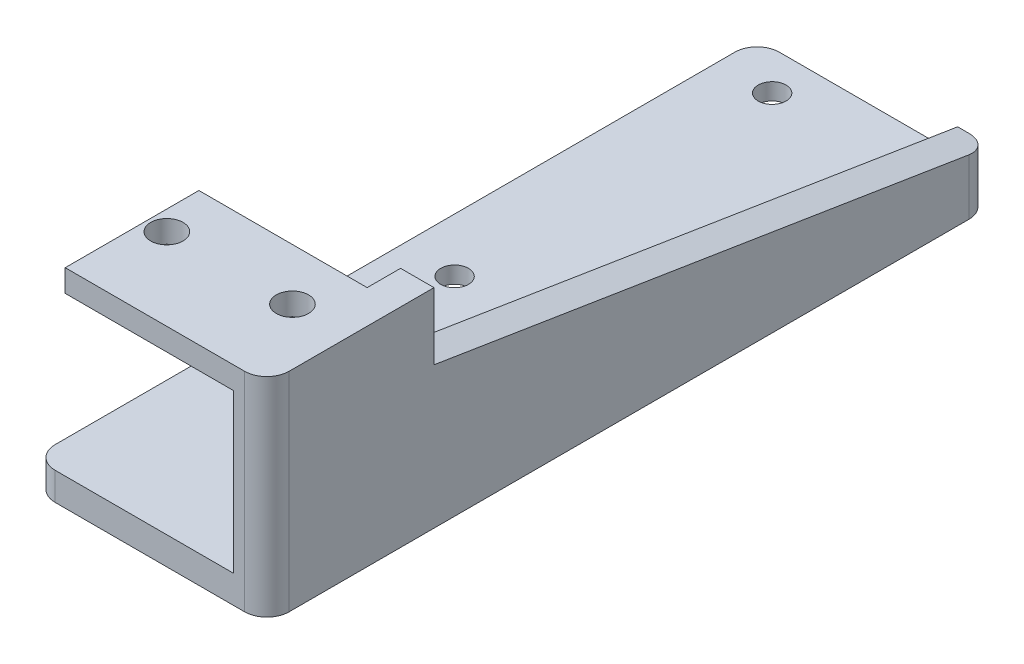
ISO-10303-21;
HEADER;
FILE_DESCRIPTION(('STEP AP214'),'2;1');
FILE_NAME('part.step','',(''),(''),'','','');
FILE_SCHEMA(('AUTOMOTIVE_DESIGN { 1 0 10303 214 1 1 1 1 }'));
ENDSEC;
DATA;
#1=APPLICATION_CONTEXT('core data for automotive mechanical design processes');
#2=APPLICATION_PROTOCOL_DEFINITION('international standard','automotive_design',2000,#1);
#3=PRODUCT_CONTEXT('',#1,'mechanical');
#4=PRODUCT('Part','Part','',(#3));
#5=PRODUCT_RELATED_PRODUCT_CATEGORY('part','',(#4));
#6=PRODUCT_DEFINITION_FORMATION('','',#4);
#7=PRODUCT_DEFINITION_CONTEXT('part definition',#1,'design');
#8=PRODUCT_DEFINITION('design','',#6,#7);
#9=PRODUCT_DEFINITION_SHAPE('','',#8);
#10=(LENGTH_UNIT() NAMED_UNIT(*) SI_UNIT(.MILLI.,.METRE.));
#11=(NAMED_UNIT(*) PLANE_ANGLE_UNIT() SI_UNIT($,.RADIAN.));
#12=(NAMED_UNIT(*) SI_UNIT($,.STERADIAN.) SOLID_ANGLE_UNIT());
#13=UNCERTAINTY_MEASURE_WITH_UNIT(LENGTH_MEASURE(1.E-05),#10,'distance_accuracy_value','');
#14=(GEOMETRIC_REPRESENTATION_CONTEXT(3) GLOBAL_UNCERTAINTY_ASSIGNED_CONTEXT((#13)) GLOBAL_UNIT_ASSIGNED_CONTEXT((#10,
#11,#12)) REPRESENTATION_CONTEXT('',''));
#15=CARTESIAN_POINT('',(0.,0.,0.));
#16=DIRECTION('',(0.,0.,1.));
#17=DIRECTION('',(1.,0.,0.));
#18=AXIS2_PLACEMENT_3D('',#15,#16,#17);
#19=CARTESIAN_POINT('',(1.95,-16.701,32.));
#20=DIRECTION('',(0.,1.,0.));
#21=DIRECTION('',(-1.,0.,0.));
#22=AXIS2_PLACEMENT_3D('',#19,#20,#21);
#23=CYLINDRICAL_SURFACE('',#22,1.25);
#24=CARTESIAN_POINT('',(1.95,-14.2,32.));
#25=DIRECTION('',(0.,1.,0.));
#26=DIRECTION('',(-1.,0.,0.));
#27=AXIS2_PLACEMENT_3D('',#24,#25,#26);
#28=CIRCLE('',#27,1.25);
#29=CARTESIAN_POINT('',(0.700000000000003,-14.2,32.));
#30=VERTEX_POINT('',#29);
#31=EDGE_CURVE('E167',#30,#30,#28,.T.);
#32=ORIENTED_EDGE('',*,*,#31,.T.);
#33=EDGE_LOOP('',(#32));
#34=FACE_BOUND('',#33,.T.);
#35=CARTESIAN_POINT('',(1.95,-15.7,32.));
#36=DIRECTION('',(0.,-1.,0.));
#37=DIRECTION('',(0.,0.,-1.));
#38=AXIS2_PLACEMENT_3D('',#35,#36,#37);
#39=CIRCLE('',#38,1.25);
#40=CARTESIAN_POINT('',(1.95,-15.7,30.75));
#41=VERTEX_POINT('',#40);
#42=EDGE_CURVE('E42',#41,#41,#39,.F.);
#43=ORIENTED_EDGE('',*,*,#42,.F.);
#44=EDGE_LOOP('',(#43));
#45=FACE_BOUND('',#44,.T.);
#46=ADVANCED_FACE('F38',(#34,#45),#23,.F.);
#47=CARTESIAN_POINT('',(1.95,-16.701,3.5));
#48=DIRECTION('',(0.,1.,0.));
#49=DIRECTION('',(-1.,0.,0.));
#50=AXIS2_PLACEMENT_3D('',#47,#48,#49);
#51=CYLINDRICAL_SURFACE('',#50,1.25);
#52=CARTESIAN_POINT('',(1.95,-14.2,3.5));
#53=DIRECTION('',(0.,1.,0.));
#54=DIRECTION('',(-1.,0.,0.));
#55=AXIS2_PLACEMENT_3D('',#52,#53,#54);
#56=CIRCLE('',#55,1.25);
#57=CARTESIAN_POINT('',(0.7,-14.2,3.5));
#58=VERTEX_POINT('',#57);
#59=EDGE_CURVE('E191',#58,#58,#56,.T.);
#60=ORIENTED_EDGE('',*,*,#59,.T.);
#61=EDGE_LOOP('',(#60));
#62=FACE_BOUND('',#61,.T.);
#63=CARTESIAN_POINT('',(1.95,-15.7,3.5));
#64=DIRECTION('',(0.,-1.,0.));
#65=DIRECTION('',(0.,0.,-1.));
#66=AXIS2_PLACEMENT_3D('',#63,#64,#65);
#67=CIRCLE('',#66,1.25);
#68=CARTESIAN_POINT('',(1.95,-15.7,2.25));
#69=VERTEX_POINT('',#68);
#70=EDGE_CURVE('E180',#69,#69,#67,.F.);
#71=ORIENTED_EDGE('',*,*,#70,.F.);
#72=EDGE_LOOP('',(#71));
#73=FACE_BOUND('',#72,.T.);
#74=ADVANCED_FACE('F425',(#62,#73),#51,.F.);
#75=CARTESIAN_POINT('',(18.1,2.,65.));
#76=DIRECTION('',(0.,-1.,0.));
#77=DIRECTION('',(1.,0.,0.));
#78=AXIS2_PLACEMENT_3D('',#75,#76,#77);
#79=PLANE('',#78);
#80=CARTESIAN_POINT('',(1.765,2.,57.64));
#81=DIRECTION('',(0.,1.,0.));
#82=DIRECTION('',(0.,0.,1.));
#83=AXIS2_PLACEMENT_3D('',#80,#81,#82);
#84=CIRCLE('',#83,1.45);
#85=CARTESIAN_POINT('',(1.765,2.,59.09));
#86=VERTEX_POINT('',#85);
#87=EDGE_CURVE('E219',#86,#86,#84,.T.);
#88=ORIENTED_EDGE('',*,*,#87,.F.);
#89=EDGE_LOOP('',(#88));
#90=FACE_BOUND('',#89,.T.);
#91=CARTESIAN_POINT('',(13.035,2.,57.64));
#92=DIRECTION('',(0.,1.,0.));
#93=DIRECTION('',(0.,0.,1.));
#94=AXIS2_PLACEMENT_3D('',#91,#92,#93);
#95=CIRCLE('',#94,1.45);
#96=CARTESIAN_POINT('',(13.035,2.,59.09));
#97=VERTEX_POINT('',#96);
#98=EDGE_CURVE('E195',#97,#97,#95,.T.);
#99=ORIENTED_EDGE('',*,*,#98,.F.);
#100=EDGE_LOOP('',(#99));
#101=FACE_BOUND('',#100,.T.);
#102=DIRECTION('',(-1.,0.,0.));
#103=VECTOR('',#102,1.);
#104=CARTESIAN_POINT('',(18.1,2.,65.));
#105=LINE('',#104,#103);
#106=CARTESIAN_POINT('',(16.1,2.,65.));
#107=VERTEX_POINT('',#106);
#108=CARTESIAN_POINT('',(0.,2.,65.));
#109=VERTEX_POINT('',#108);
#110=EDGE_CURVE('E230',#107,#109,#105,.T.);
#111=ORIENTED_EDGE('',*,*,#110,.F.);
#112=CARTESIAN_POINT('',(16.1,2.,63.));
#113=DIRECTION('',(0.,-1.,0.));
#114=DIRECTION('',(1.,0.,0.));
#115=AXIS2_PLACEMENT_3D('',#112,#113,#114);
#116=CIRCLE('',#115,2.);
#117=CARTESIAN_POINT('',(18.1,2.,63.));
#118=VERTEX_POINT('',#117);
#119=EDGE_CURVE('E298',#107,#118,#116,.F.);
#120=ORIENTED_EDGE('',*,*,#119,.T.);
#121=DIRECTION('',(0.,0.,-1.));
#122=VECTOR('',#121,1.);
#123=CARTESIAN_POINT('',(18.1,2.,65.));
#124=LINE('',#123,#122);
#125=CARTESIAN_POINT('',(18.1,2.,50.));
#126=VERTEX_POINT('',#125);
#127=EDGE_CURVE('E251',#118,#126,#124,.T.);
#128=ORIENTED_EDGE('',*,*,#127,.T.);
#129=DIRECTION('',(1.,0.,0.));
#130=VECTOR('',#129,1.);
#131=CARTESIAN_POINT('',(-2.901,2.,50.));
#132=LINE('',#131,#130);
#133=CARTESIAN_POINT('',(15.1,2.,50.));
#134=VERTEX_POINT('',#133);
#135=EDGE_CURVE('E168',#134,#126,#132,.T.);
#136=ORIENTED_EDGE('',*,*,#135,.F.);
#137=DIRECTION('',(0.,0.,-1.));
#138=VECTOR('',#137,1.);
#139=CARTESIAN_POINT('',(15.1,2.,0.));
#140=LINE('',#139,#138);
#141=CARTESIAN_POINT('',(15.1,2.,53.));
#142=VERTEX_POINT('',#141);
#143=EDGE_CURVE('E173',#142,#134,#140,.T.);
#144=ORIENTED_EDGE('',*,*,#143,.F.);
#145=DIRECTION('',(1.,0.,0.));
#146=VECTOR('',#145,1.);
#147=CARTESIAN_POINT('',(0.,2.,53.));
#148=LINE('',#147,#146);
#149=CARTESIAN_POINT('',(0.,2.,53.));
#150=VERTEX_POINT('',#149);
#151=EDGE_CURVE('E205',#150,#142,#148,.T.);
#152=ORIENTED_EDGE('',*,*,#151,.F.);
#153=DIRECTION('',(0.,0.,-1.));
#154=VECTOR('',#153,1.);
#155=CARTESIAN_POINT('',(0.,2.,65.));
#156=LINE('',#155,#154);
#157=EDGE_CURVE('E286',#109,#150,#156,.T.);
#158=ORIENTED_EDGE('',*,*,#157,.F.);
#159=EDGE_LOOP('',(#111,#120,#128,#136,#144,#152,#158));
#160=FACE_BOUND('',#159,.T.);
#161=ADVANCED_FACE('F384',(#90,#101,#160),#79,.F.);
#162=CARTESIAN_POINT('',(0.,2.,65.));
#163=DIRECTION('',(1.,0.,0.));
#164=DIRECTION('',(0.,0.,-1.));
#165=AXIS2_PLACEMENT_3D('',#162,#163,#164);
#166=PLANE('',#165);
#167=ORIENTED_EDGE('',*,*,#157,.T.);
#168=DIRECTION('',(0.,1.,0.));
#169=VECTOR('',#168,1.);
#170=CARTESIAN_POINT('',(0.,-16.701,53.));
#171=LINE('',#170,#169);
#172=CARTESIAN_POINT('',(0.,0.,53.));
#173=VERTEX_POINT('',#172);
#174=EDGE_CURVE('E212',#173,#150,#171,.T.);
#175=ORIENTED_EDGE('',*,*,#174,.F.);
#176=DIRECTION('',(0.,0.,-1.));
#177=VECTOR('',#176,1.);
#178=CARTESIAN_POINT('',(0.,0.,65.));
#179=LINE('',#178,#177);
#180=CARTESIAN_POINT('',(0.,0.,65.));
#181=VERTEX_POINT('',#180);
#182=EDGE_CURVE('E282',#181,#173,#179,.T.);
#183=ORIENTED_EDGE('',*,*,#182,.F.);
#184=DIRECTION('',(0.,-1.,0.));
#185=VECTOR('',#184,1.);
#186=CARTESIAN_POINT('',(0.,2.,65.));
#187=LINE('',#186,#185);
#188=EDGE_CURVE('E233',#109,#181,#187,.T.);
#189=ORIENTED_EDGE('',*,*,#188,.F.);
#190=EDGE_LOOP('',(#167,#175,#183,#189));
#191=FACE_BOUND('',#190,.T.);
#192=ADVANCED_FACE('F389',(#191),#166,.F.);
#193=CARTESIAN_POINT('',(0.,0.,65.));
#194=DIRECTION('',(0.,1.,0.));
#195=DIRECTION('',(0.,0.,1.));
#196=AXIS2_PLACEMENT_3D('',#193,#194,#195);
#197=PLANE('',#196);
#198=CARTESIAN_POINT('',(1.765,0.,57.64));
#199=DIRECTION('',(0.,1.,0.));
#200=DIRECTION('',(0.,0.,1.));
#201=AXIS2_PLACEMENT_3D('',#198,#199,#200);
#202=CIRCLE('',#201,1.45);
#203=CARTESIAN_POINT('',(1.765,0.,59.09));
#204=VERTEX_POINT('',#203);
#205=EDGE_CURVE('E215',#204,#204,#202,.F.);
#206=ORIENTED_EDGE('',*,*,#205,.F.);
#207=EDGE_LOOP('',(#206));
#208=FACE_BOUND('',#207,.T.);
#209=CARTESIAN_POINT('',(13.035,0.,57.64));
#210=DIRECTION('',(0.,1.,0.));
#211=DIRECTION('',(0.,0.,1.));
#212=AXIS2_PLACEMENT_3D('',#209,#210,#211);
#213=CIRCLE('',#212,1.45);
#214=CARTESIAN_POINT('',(13.035,0.,59.09));
#215=VERTEX_POINT('',#214);
#216=EDGE_CURVE('E223',#215,#215,#213,.F.);
#217=ORIENTED_EDGE('',*,*,#216,.F.);
#218=EDGE_LOOP('',(#217));
#219=FACE_BOUND('',#218,.T.);
#220=ORIENTED_EDGE('',*,*,#182,.T.);
#221=DIRECTION('',(-1.,0.,0.));
#222=VECTOR('',#221,1.);
#223=CARTESIAN_POINT('',(0.,0.,53.));
#224=LINE('',#223,#222);
#225=CARTESIAN_POINT('',(15.1,0.,53.));
#226=VERTEX_POINT('',#225);
#227=EDGE_CURVE('E199',#226,#173,#224,.T.);
#228=ORIENTED_EDGE('',*,*,#227,.F.);
#229=DIRECTION('',(0.,0.,-1.));
#230=VECTOR('',#229,1.);
#231=CARTESIAN_POINT('',(15.1,0.,65.));
#232=LINE('',#231,#230);
#233=CARTESIAN_POINT('',(15.1,0.,65.));
#234=VERTEX_POINT('',#233);
#235=EDGE_CURVE('E278',#234,#226,#232,.T.);
#236=ORIENTED_EDGE('',*,*,#235,.F.);
#237=DIRECTION('',(1.,0.,0.));
#238=VECTOR('',#237,1.);
#239=CARTESIAN_POINT('',(0.,0.,65.));
#240=LINE('',#239,#238);
#241=EDGE_CURVE('E237',#181,#234,#240,.T.);
#242=ORIENTED_EDGE('',*,*,#241,.F.);
#243=EDGE_LOOP('',(#220,#228,#236,#242));
#244=FACE_BOUND('',#243,.T.);
#245=ADVANCED_FACE('F397',(#208,#219,#244),#197,.F.);
#246=CARTESIAN_POINT('',(15.1,0.,65.));
#247=DIRECTION('',(1.,0.,0.));
#248=DIRECTION('',(0.,1.,0.));
#249=AXIS2_PLACEMENT_3D('',#246,#247,#248);
#250=PLANE('',#249);
#251=ORIENTED_EDGE('',*,*,#143,.T.);
#252=DIRECTION('',(0.,1.,0.));
#253=VECTOR('',#252,1.);
#254=CARTESIAN_POINT('',(15.1,-4.,50.));
#255=LINE('',#254,#253);
#256=CARTESIAN_POINT('',(15.1,-4.,50.));
#257=VERTEX_POINT('',#256);
#258=EDGE_CURVE('E152',#257,#134,#255,.T.);
#259=ORIENTED_EDGE('',*,*,#258,.F.);
#260=DIRECTION('',(0.,0.157990501106673,0.987440631916706));
#261=VECTOR('',#260,1.);
#262=CARTESIAN_POINT('',(15.1,-12.,0.));
#263=LINE('',#262,#261);
#264=CARTESIAN_POINT('',(15.1,-12.,0.));
#265=VERTEX_POINT('',#264);
#266=EDGE_CURVE('E162',#265,#257,#263,.T.);
#267=ORIENTED_EDGE('',*,*,#266,.F.);
#268=DIRECTION('',(0.,-1.,0.));
#269=VECTOR('',#268,1.);
#270=CARTESIAN_POINT('',(15.1,0.,0.));
#271=LINE('',#270,#269);
#272=CARTESIAN_POINT('',(15.1,-14.2,0.));
#273=VERTEX_POINT('',#272);
#274=EDGE_CURVE('E202',#265,#273,#271,.T.);
#275=ORIENTED_EDGE('',*,*,#274,.T.);
#276=DIRECTION('',(0.,0.,-1.));
#277=VECTOR('',#276,1.);
#278=CARTESIAN_POINT('',(15.1,-14.2,65.));
#279=LINE('',#278,#277);
#280=CARTESIAN_POINT('',(15.1,-14.2,65.));
#281=VERTEX_POINT('',#280);
#282=EDGE_CURVE('E274',#281,#273,#279,.T.);
#283=ORIENTED_EDGE('',*,*,#282,.F.);
#284=DIRECTION('',(0.,-1.,0.));
#285=VECTOR('',#284,1.);
#286=CARTESIAN_POINT('',(15.1,0.,65.));
#287=LINE('',#286,#285);
#288=EDGE_CURVE('E240',#234,#281,#287,.T.);
#289=ORIENTED_EDGE('',*,*,#288,.F.);
#290=ORIENTED_EDGE('',*,*,#235,.T.);
#291=DIRECTION('',(0.,1.,0.));
#292=VECTOR('',#291,1.);
#293=CARTESIAN_POINT('',(15.1,-16.701,53.));
#294=LINE('',#293,#292);
#295=EDGE_CURVE('E209',#226,#142,#294,.T.);
#296=ORIENTED_EDGE('',*,*,#295,.T.);
#297=EDGE_LOOP('',(#251,#259,#267,#275,#283,#289,#290,#296));
#298=FACE_BOUND('',#297,.T.);
#299=ADVANCED_FACE('F171',(#298),#250,.F.);
#300=CARTESIAN_POINT('',(15.1,-14.2,65.));
#301=DIRECTION('',(0.,-1.,0.));
#302=DIRECTION('',(0.,0.,-1.));
#303=AXIS2_PLACEMENT_3D('',#300,#301,#302);
#304=PLANE('',#303);
#305=ORIENTED_EDGE('',*,*,#59,.F.);
#306=EDGE_LOOP('',(#305));
#307=FACE_BOUND('',#306,.T.);
#308=ORIENTED_EDGE('',*,*,#31,.F.);
#309=EDGE_LOOP('',(#308));
#310=FACE_BOUND('',#309,.T.);
#311=DIRECTION('',(0.,0.,-1.));
#312=VECTOR('',#311,1.);
#313=CARTESIAN_POINT('',(-2.9,-14.2,65.));
#314=LINE('',#313,#312);
#315=CARTESIAN_POINT('',(-2.9,-14.2,63.));
#316=VERTEX_POINT('',#315);
#317=CARTESIAN_POINT('',(-2.9,-14.2,2.));
#318=VERTEX_POINT('',#317);
#319=EDGE_CURVE('E270',#316,#318,#314,.T.);
#320=ORIENTED_EDGE('',*,*,#319,.F.);
#321=CARTESIAN_POINT('',(-0.899999999999998,-14.2,63.));
#322=DIRECTION('',(0.,-1.,0.));
#323=DIRECTION('',(0.,0.,-1.));
#324=AXIS2_PLACEMENT_3D('',#321,#322,#323);
#325=CIRCLE('',#324,2.);
#326=CARTESIAN_POINT('',(-0.9,-14.2,65.));
#327=VERTEX_POINT('',#326);
#328=EDGE_CURVE('E330',#316,#327,#325,.F.);
#329=ORIENTED_EDGE('',*,*,#328,.T.);
#330=DIRECTION('',(-1.,0.,0.));
#331=VECTOR('',#330,1.);
#332=CARTESIAN_POINT('',(15.1,-14.2,65.));
#333=LINE('',#332,#331);
#334=EDGE_CURVE('E243',#281,#327,#333,.T.);
#335=ORIENTED_EDGE('',*,*,#334,.F.);
#336=ORIENTED_EDGE('',*,*,#282,.T.);
#337=DIRECTION('',(-1.,0.,0.));
#338=VECTOR('',#337,1.);
#339=CARTESIAN_POINT('',(15.1,-14.2,0.));
#340=LINE('',#339,#338);
#341=CARTESIAN_POINT('',(-0.9,-14.2,0.));
#342=VERTEX_POINT('',#341);
#343=EDGE_CURVE('E254',#273,#342,#340,.T.);
#344=ORIENTED_EDGE('',*,*,#343,.T.);
#345=CARTESIAN_POINT('',(-0.899999999999998,-14.2,2.));
#346=DIRECTION('',(0.,-1.,0.));
#347=DIRECTION('',(0.,0.,-1.));
#348=AXIS2_PLACEMENT_3D('',#345,#346,#347);
#349=CIRCLE('',#348,2.);
#350=EDGE_CURVE('E327',#342,#318,#349,.F.);
#351=ORIENTED_EDGE('',*,*,#350,.T.);
#352=EDGE_LOOP('',(#320,#329,#335,#336,#344,#351));
#353=FACE_BOUND('',#352,.T.);
#354=ADVANCED_FACE('F401',(#307,#310,#353),#304,.F.);
#355=CARTESIAN_POINT('',(-2.9,-14.2,65.));
#356=DIRECTION('',(1.,0.,0.));
#357=DIRECTION('',(0.,1.,0.));
#358=AXIS2_PLACEMENT_3D('',#355,#356,#357);
#359=PLANE('',#358);
#360=DIRECTION('',(0.,0.,-1.));
#361=VECTOR('',#360,1.);
#362=CARTESIAN_POINT('',(-2.9,-16.7,65.));
#363=LINE('',#362,#361);
#364=CARTESIAN_POINT('',(-2.9,-16.7,63.));
#365=VERTEX_POINT('',#364);
#366=CARTESIAN_POINT('',(-2.9,-16.7,2.));
#367=VERTEX_POINT('',#366);
#368=EDGE_CURVE('E266',#365,#367,#363,.T.);
#369=ORIENTED_EDGE('',*,*,#368,.F.);
#370=DIRECTION('',(0.,-1.,0.));
#371=VECTOR('',#370,1.);
#372=CARTESIAN_POINT('',(-2.9,-14.2,63.));
#373=LINE('',#372,#371);
#374=EDGE_CURVE('E324',#365,#316,#373,.F.);
#375=ORIENTED_EDGE('',*,*,#374,.T.);
#376=ORIENTED_EDGE('',*,*,#319,.T.);
#377=DIRECTION('',(0.,-1.,0.));
#378=VECTOR('',#377,1.);
#379=CARTESIAN_POINT('',(-2.9,-14.2,2.));
#380=LINE('',#379,#378);
#381=EDGE_CURVE('E320',#318,#367,#380,.T.);
#382=ORIENTED_EDGE('',*,*,#381,.T.);
#383=EDGE_LOOP('',(#369,#375,#376,#382));
#384=FACE_BOUND('',#383,.T.);
#385=ADVANCED_FACE('F365',(#384),#359,.F.);
#386=CARTESIAN_POINT('',(-2.9,-16.7,65.));
#387=DIRECTION('',(0.,1.,0.));
#388=DIRECTION('',(0.,0.,1.));
#389=AXIS2_PLACEMENT_3D('',#386,#387,#388);
#390=PLANE('',#389);
#391=CARTESIAN_POINT('',(1.95,-16.7,32.));
#392=DIRECTION('',(0.,-1.,0.));
#393=DIRECTION('',(0.,0.,-1.));
#394=AXIS2_PLACEMENT_3D('',#391,#392,#393);
#395=CIRCLE('',#394,2.7);
#396=CARTESIAN_POINT('',(1.95,-16.7,29.3));
#397=VERTEX_POINT('',#396);
#398=EDGE_CURVE('E343',#397,#397,#395,.T.);
#399=ORIENTED_EDGE('',*,*,#398,.F.);
#400=EDGE_LOOP('',(#399));
#401=FACE_BOUND('',#400,.T.);
#402=CARTESIAN_POINT('',(1.95,-16.7,3.5));
#403=DIRECTION('',(0.,-1.,0.));
#404=DIRECTION('',(0.,0.,-1.));
#405=AXIS2_PLACEMENT_3D('',#402,#403,#404);
#406=CIRCLE('',#405,2.7);
#407=CARTESIAN_POINT('',(1.95,-16.7,0.799999999999999));
#408=VERTEX_POINT('',#407);
#409=EDGE_CURVE('E182',#408,#408,#406,.T.);
#410=ORIENTED_EDGE('',*,*,#409,.F.);
#411=EDGE_LOOP('',(#410));
#412=FACE_BOUND('',#411,.T.);
#413=DIRECTION('',(0.,0.,-1.));
#414=VECTOR('',#413,1.);
#415=CARTESIAN_POINT('',(18.1,-16.7,65.));
#416=LINE('',#415,#414);
#417=CARTESIAN_POINT('',(18.1,-16.7,63.));
#418=VERTEX_POINT('',#417);
#419=CARTESIAN_POINT('',(18.1,-16.7,2.));
#420=VERTEX_POINT('',#419);
#421=EDGE_CURVE('E262',#418,#420,#416,.T.);
#422=ORIENTED_EDGE('',*,*,#421,.F.);
#423=CARTESIAN_POINT('',(16.1,-16.7,63.));
#424=DIRECTION('',(0.,1.,0.));
#425=DIRECTION('',(0.,0.,1.));
#426=AXIS2_PLACEMENT_3D('',#423,#424,#425);
#427=CIRCLE('',#426,2.);
#428=CARTESIAN_POINT('',(16.1,-16.7,65.));
#429=VERTEX_POINT('',#428);
#430=EDGE_CURVE('E317',#418,#429,#427,.F.);
#431=ORIENTED_EDGE('',*,*,#430,.T.);
#432=DIRECTION('',(1.,0.,0.));
#433=VECTOR('',#432,1.);
#434=CARTESIAN_POINT('',(-2.9,-16.7,65.));
#435=LINE('',#434,#433);
#436=CARTESIAN_POINT('',(-0.9,-16.7,65.));
#437=VERTEX_POINT('',#436);
#438=EDGE_CURVE('E247',#437,#429,#435,.T.);
#439=ORIENTED_EDGE('',*,*,#438,.F.);
#440=CARTESIAN_POINT('',(-0.899999999999999,-16.7,63.));
#441=DIRECTION('',(0.,1.,0.));
#442=DIRECTION('',(0.,0.,1.));
#443=AXIS2_PLACEMENT_3D('',#440,#441,#442);
#444=CIRCLE('',#443,2.);
#445=EDGE_CURVE('E314',#437,#365,#444,.F.);
#446=ORIENTED_EDGE('',*,*,#445,.T.);
#447=ORIENTED_EDGE('',*,*,#368,.T.);
#448=CARTESIAN_POINT('',(-0.899999999999999,-16.7,2.));
#449=DIRECTION('',(0.,1.,0.));
#450=DIRECTION('',(0.,0.,1.));
#451=AXIS2_PLACEMENT_3D('',#448,#449,#450);
#452=CIRCLE('',#451,2.);
#453=CARTESIAN_POINT('',(-0.9,-16.7,0.));
#454=VERTEX_POINT('',#453);
#455=EDGE_CURVE('E308',#367,#454,#452,.F.);
#456=ORIENTED_EDGE('',*,*,#455,.T.);
#457=DIRECTION('',(1.,0.,0.));
#458=VECTOR('',#457,1.);
#459=CARTESIAN_POINT('',(-2.9,-16.7,0.));
#460=LINE('',#459,#458);
#461=CARTESIAN_POINT('',(16.1,-16.7,0.));
#462=VERTEX_POINT('',#461);
#463=EDGE_CURVE('E234',#454,#462,#460,.T.);
#464=ORIENTED_EDGE('',*,*,#463,.T.);
#465=CARTESIAN_POINT('',(16.1,-16.7,2.));
#466=DIRECTION('',(0.,1.,0.));
#467=DIRECTION('',(0.,0.,1.));
#468=AXIS2_PLACEMENT_3D('',#465,#466,#467);
#469=CIRCLE('',#468,2.);
#470=EDGE_CURVE('E311',#462,#420,#469,.F.);
#471=ORIENTED_EDGE('',*,*,#470,.T.);
#472=EDGE_LOOP('',(#422,#431,#439,#446,#447,#456,#464,#471));
#473=FACE_BOUND('',#472,.T.);
#474=ADVANCED_FACE('F361',(#401,#412,#473),#390,.F.);
#475=CARTESIAN_POINT('',(18.1,-16.7,65.));
#476=DIRECTION('',(-1.,0.,0.));
#477=DIRECTION('',(0.,0.,1.));
#478=AXIS2_PLACEMENT_3D('',#475,#476,#477);
#479=PLANE('',#478);
#480=ORIENTED_EDGE('',*,*,#127,.F.);
#481=DIRECTION('',(0.,1.,0.));
#482=VECTOR('',#481,1.);
#483=CARTESIAN_POINT('',(18.1,-16.7,63.));
#484=LINE('',#483,#482);
#485=EDGE_CURVE('E305',#118,#418,#484,.F.);
#486=ORIENTED_EDGE('',*,*,#485,.T.);
#487=ORIENTED_EDGE('',*,*,#421,.T.);
#488=DIRECTION('',(0.,1.,0.));
#489=VECTOR('',#488,1.);
#490=CARTESIAN_POINT('',(18.1,-16.7,2.));
#491=LINE('',#490,#489);
#492=CARTESIAN_POINT('',(18.1,-11.68,2.));
#493=VERTEX_POINT('',#492);
#494=EDGE_CURVE('E301',#420,#493,#491,.T.);
#495=ORIENTED_EDGE('',*,*,#494,.T.);
#496=DIRECTION('',(0.,-0.157990501106673,-0.987440631916705));
#497=VECTOR('',#496,1.);
#498=CARTESIAN_POINT('',(18.1,-12.,0.));
#499=LINE('',#498,#497);
#500=CARTESIAN_POINT('',(18.1,-4.,50.));
#501=VERTEX_POINT('',#500);
#502=EDGE_CURVE('E159',#501,#493,#499,.T.);
#503=ORIENTED_EDGE('',*,*,#502,.F.);
#504=DIRECTION('',(0.,-1.,0.));
#505=VECTOR('',#504,1.);
#506=CARTESIAN_POINT('',(18.1,-4.,50.));
#507=LINE('',#506,#505);
#508=EDGE_CURVE('E155',#126,#501,#507,.T.);
#509=ORIENTED_EDGE('',*,*,#508,.F.);
#510=EDGE_LOOP('',(#480,#486,#487,#495,#503,#509));
#511=FACE_BOUND('',#510,.T.);
#512=ADVANCED_FACE('F364',(#511),#479,.F.);
#513=CARTESIAN_POINT('',(0.,0.,65.));
#514=DIRECTION('',(0.,0.,1.));
#515=DIRECTION('',(1.,0.,0.));
#516=AXIS2_PLACEMENT_3D('',#513,#514,#515);
#517=PLANE('',#516);
#518=ORIENTED_EDGE('',*,*,#438,.T.);
#519=DIRECTION('',(0.,1.,0.));
#520=VECTOR('',#519,1.);
#521=CARTESIAN_POINT('',(16.1,2.,65.));
#522=LINE('',#521,#520);
#523=EDGE_CURVE('E294',#429,#107,#522,.T.);
#524=ORIENTED_EDGE('',*,*,#523,.T.);
#525=ORIENTED_EDGE('',*,*,#110,.T.);
#526=ORIENTED_EDGE('',*,*,#188,.T.);
#527=ORIENTED_EDGE('',*,*,#241,.T.);
#528=ORIENTED_EDGE('',*,*,#288,.T.);
#529=ORIENTED_EDGE('',*,*,#334,.T.);
#530=DIRECTION('',(0.,-1.,0.));
#531=VECTOR('',#530,1.);
#532=CARTESIAN_POINT('',(-0.899999999999999,-16.7,65.));
#533=LINE('',#532,#531);
#534=EDGE_CURVE('E290',#327,#437,#533,.T.);
#535=ORIENTED_EDGE('',*,*,#534,.T.);
#536=EDGE_LOOP('',(#518,#524,#525,#526,#527,#528,#529,#535));
#537=FACE_BOUND('',#536,.T.);
#538=ADVANCED_FACE('F380',(#537),#517,.T.);
#539=CARTESIAN_POINT('',(0.,0.,0.));
#540=DIRECTION('',(0.,0.,1.));
#541=DIRECTION('',(1.,0.,0.));
#542=AXIS2_PLACEMENT_3D('',#539,#540,#541);
#543=PLANE('',#542);
#544=DIRECTION('',(1.,0.,0.));
#545=VECTOR('',#544,1.);
#546=CARTESIAN_POINT('',(-2.901,-12.,0.));
#547=LINE('',#546,#545);
#548=CARTESIAN_POINT('',(16.1,-12.,0.));
#549=VERTEX_POINT('',#548);
#550=EDGE_CURVE('E158',#265,#549,#547,.T.);
#551=ORIENTED_EDGE('',*,*,#550,.T.);
#552=DIRECTION('',(0.,1.,0.));
#553=VECTOR('',#552,1.);
#554=CARTESIAN_POINT('',(16.1,0.,0.));
#555=LINE('',#554,#553);
#556=EDGE_CURVE('E11',#549,#462,#555,.F.);
#557=ORIENTED_EDGE('',*,*,#556,.T.);
#558=ORIENTED_EDGE('',*,*,#463,.F.);
#559=DIRECTION('',(0.,-1.,0.));
#560=VECTOR('',#559,1.);
#561=CARTESIAN_POINT('',(-0.899999999999991,0.,0.));
#562=LINE('',#561,#560);
#563=EDGE_CURVE('E48',#454,#342,#562,.F.);
#564=ORIENTED_EDGE('',*,*,#563,.T.);
#565=ORIENTED_EDGE('',*,*,#343,.F.);
#566=ORIENTED_EDGE('',*,*,#274,.F.);
#567=EDGE_LOOP('',(#551,#557,#558,#564,#565,#566));
#568=FACE_BOUND('',#567,.T.);
#569=ADVANCED_FACE('F412',(#568),#543,.F.);
#570=CARTESIAN_POINT('',(0.,-16.701,53.));
#571=DIRECTION('',(0.,0.,1.));
#572=DIRECTION('',(1.,0.,0.));
#573=AXIS2_PLACEMENT_3D('',#570,#571,#572);
#574=PLANE('',#573);
#575=ORIENTED_EDGE('',*,*,#227,.T.);
#576=ORIENTED_EDGE('',*,*,#174,.T.);
#577=ORIENTED_EDGE('',*,*,#151,.T.);
#578=ORIENTED_EDGE('',*,*,#295,.F.);
#579=EDGE_LOOP('',(#575,#576,#577,#578));
#580=FACE_BOUND('',#579,.T.);
#581=ADVANCED_FACE('F437',(#580),#574,.F.);
#582=CARTESIAN_POINT('',(13.035,-16.701,57.64));
#583=DIRECTION('',(0.,1.,0.));
#584=DIRECTION('',(0.,0.,1.));
#585=AXIS2_PLACEMENT_3D('',#582,#583,#584);
#586=CYLINDRICAL_SURFACE('',#585,1.45);
#587=ORIENTED_EDGE('',*,*,#98,.T.);
#588=EDGE_LOOP('',(#587));
#589=FACE_BOUND('',#588,.T.);
#590=ORIENTED_EDGE('',*,*,#216,.T.);
#591=EDGE_LOOP('',(#590));
#592=FACE_BOUND('',#591,.T.);
#593=ADVANCED_FACE('F440',(#589,#592),#586,.F.);
#594=CARTESIAN_POINT('',(1.765,-16.701,57.64));
#595=DIRECTION('',(0.,1.,0.));
#596=DIRECTION('',(0.,0.,1.));
#597=AXIS2_PLACEMENT_3D('',#594,#595,#596);
#598=CYLINDRICAL_SURFACE('',#597,1.45);
#599=ORIENTED_EDGE('',*,*,#87,.T.);
#600=EDGE_LOOP('',(#599));
#601=FACE_BOUND('',#600,.T.);
#602=ORIENTED_EDGE('',*,*,#205,.T.);
#603=EDGE_LOOP('',(#602));
#604=FACE_BOUND('',#603,.T.);
#605=ADVANCED_FACE('F442',(#601,#604),#598,.F.);
#606=CARTESIAN_POINT('',(-2.901,-4.,50.));
#607=DIRECTION('',(0.,0.,1.));
#608=DIRECTION('',(1.,0.,0.));
#609=AXIS2_PLACEMENT_3D('',#606,#607,#608);
#610=PLANE('',#609);
#611=ORIENTED_EDGE('',*,*,#258,.T.);
#612=ORIENTED_EDGE('',*,*,#135,.T.);
#613=ORIENTED_EDGE('',*,*,#508,.T.);
#614=DIRECTION('',(1.,0.,0.));
#615=VECTOR('',#614,1.);
#616=CARTESIAN_POINT('',(-2.901,-4.,50.));
#617=LINE('',#616,#615);
#618=EDGE_CURVE('E147',#257,#501,#617,.T.);
#619=ORIENTED_EDGE('',*,*,#618,.F.);
#620=EDGE_LOOP('',(#611,#612,#613,#619));
#621=FACE_BOUND('',#620,.T.);
#622=ADVANCED_FACE('F149',(#621),#610,.F.);
#623=CARTESIAN_POINT('',(-2.901,-12.,0.));
#624=DIRECTION('',(0.,-0.987440631916705,0.157990501106673));
#625=DIRECTION('',(0.,-0.157990501106673,-0.987440631916706));
#626=AXIS2_PLACEMENT_3D('',#623,#624,#625);
#627=PLANE('',#626);
#628=ORIENTED_EDGE('',*,*,#502,.T.);
#629=CARTESIAN_POINT('',(16.1,-11.68,2.));
#630=DIRECTION('',(0.,-0.987440631916705,0.157990501106673));
#631=DIRECTION('',(0.,0.157990501106673,0.987440631916706));
#632=AXIS2_PLACEMENT_3D('',#629,#630,#631);
#633=ELLIPSE('',#632,2.02543822418755,2.);
#634=EDGE_CURVE('E56',#493,#549,#633,.F.);
#635=ORIENTED_EDGE('',*,*,#634,.T.);
#636=ORIENTED_EDGE('',*,*,#550,.F.);
#637=ORIENTED_EDGE('',*,*,#266,.T.);
#638=ORIENTED_EDGE('',*,*,#618,.T.);
#639=EDGE_LOOP('',(#628,#635,#636,#637,#638));
#640=FACE_BOUND('',#639,.T.);
#641=ADVANCED_FACE('F163',(#640),#627,.F.);
#642=CARTESIAN_POINT('',(16.1,0.,63.));
#643=DIRECTION('',(0.,-1.,0.));
#644=DIRECTION('',(0.,0.,-1.));
#645=AXIS2_PLACEMENT_3D('',#642,#643,#644);
#646=CYLINDRICAL_SURFACE('',#645,2.);
#647=ORIENTED_EDGE('',*,*,#430,.F.);
#648=ORIENTED_EDGE('',*,*,#485,.F.);
#649=ORIENTED_EDGE('',*,*,#119,.F.);
#650=ORIENTED_EDGE('',*,*,#523,.F.);
#651=EDGE_LOOP('',(#647,#648,#649,#650));
#652=FACE_BOUND('',#651,.T.);
#653=ADVANCED_FACE('F377',(#652),#646,.T.);
#654=CARTESIAN_POINT('',(-0.899999999999991,0.,63.));
#655=DIRECTION('',(0.,1.,0.));
#656=DIRECTION('',(-1.,0.,0.));
#657=AXIS2_PLACEMENT_3D('',#654,#655,#656);
#658=CYLINDRICAL_SURFACE('',#657,2.);
#659=ORIENTED_EDGE('',*,*,#328,.F.);
#660=ORIENTED_EDGE('',*,*,#374,.F.);
#661=ORIENTED_EDGE('',*,*,#445,.F.);
#662=ORIENTED_EDGE('',*,*,#534,.F.);
#663=EDGE_LOOP('',(#659,#660,#661,#662));
#664=FACE_BOUND('',#663,.T.);
#665=ADVANCED_FACE('F405',(#664),#658,.T.);
#666=CARTESIAN_POINT('',(16.1,-16.7,2.));
#667=DIRECTION('',(0.,1.,0.));
#668=DIRECTION('',(0.,0.,1.));
#669=AXIS2_PLACEMENT_3D('',#666,#667,#668);
#670=CYLINDRICAL_SURFACE('',#669,2.);
#671=ORIENTED_EDGE('',*,*,#470,.F.);
#672=ORIENTED_EDGE('',*,*,#556,.F.);
#673=ORIENTED_EDGE('',*,*,#634,.F.);
#674=ORIENTED_EDGE('',*,*,#494,.F.);
#675=EDGE_LOOP('',(#671,#672,#673,#674));
#676=FACE_BOUND('',#675,.T.);
#677=ADVANCED_FACE('F415',(#676),#670,.T.);
#678=CARTESIAN_POINT('',(-0.899999999999998,-14.2,2.));
#679=DIRECTION('',(0.,-1.,0.));
#680=DIRECTION('',(1.,0.,0.));
#681=AXIS2_PLACEMENT_3D('',#678,#679,#680);
#682=CYLINDRICAL_SURFACE('',#681,2.);
#683=ORIENTED_EDGE('',*,*,#350,.F.);
#684=ORIENTED_EDGE('',*,*,#563,.F.);
#685=ORIENTED_EDGE('',*,*,#455,.F.);
#686=ORIENTED_EDGE('',*,*,#381,.F.);
#687=EDGE_LOOP('',(#683,#684,#685,#686));
#688=FACE_BOUND('',#687,.T.);
#689=ADVANCED_FACE('F40',(#688),#682,.T.);
#690=CARTESIAN_POINT('',(1.95,-15.7,3.5));
#691=DIRECTION('',(0.,-1.,0.));
#692=DIRECTION('',(0.,0.,-1.));
#693=AXIS2_PLACEMENT_3D('',#690,#691,#692);
#694=PLANE('',#693);
#695=CARTESIAN_POINT('',(1.95,-15.7,3.5));
#696=DIRECTION('',(0.,-1.,0.));
#697=DIRECTION('',(0.,0.,-1.));
#698=AXIS2_PLACEMENT_3D('',#695,#696,#697);
#699=CIRCLE('',#698,2.7);
#700=CARTESIAN_POINT('',(1.95,-15.7,0.799999999999999));
#701=VERTEX_POINT('',#700);
#702=EDGE_CURVE('E349',#701,#701,#699,.T.);
#703=ORIENTED_EDGE('',*,*,#702,.T.);
#704=EDGE_LOOP('',(#703));
#705=FACE_BOUND('',#704,.T.);
#706=ORIENTED_EDGE('',*,*,#70,.T.);
#707=EDGE_LOOP('',(#706));
#708=FACE_BOUND('',#707,.T.);
#709=ADVANCED_FACE('F501',(#705,#708),#694,.T.);
#710=CARTESIAN_POINT('',(1.95,-15.7,3.5));
#711=DIRECTION('',(0.,-1.,0.));
#712=DIRECTION('',(0.,0.,-1.));
#713=AXIS2_PLACEMENT_3D('',#710,#711,#712);
#714=CYLINDRICAL_SURFACE('',#713,2.7);
#715=ORIENTED_EDGE('',*,*,#702,.F.);
#716=EDGE_LOOP('',(#715));
#717=FACE_BOUND('',#716,.T.);
#718=ORIENTED_EDGE('',*,*,#409,.T.);
#719=EDGE_LOOP('',(#718));
#720=FACE_BOUND('',#719,.T.);
#721=ADVANCED_FACE('F359',(#717,#720),#714,.F.);
#722=CARTESIAN_POINT('',(1.95,-15.7,32.));
#723=DIRECTION('',(0.,-1.,0.));
#724=DIRECTION('',(0.,0.,-1.));
#725=AXIS2_PLACEMENT_3D('',#722,#723,#724);
#726=PLANE('',#725);
#727=CARTESIAN_POINT('',(1.95,-15.7,32.));
#728=DIRECTION('',(0.,-1.,0.));
#729=DIRECTION('',(0.,0.,-1.));
#730=AXIS2_PLACEMENT_3D('',#727,#728,#729);
#731=CIRCLE('',#730,2.7);
#732=CARTESIAN_POINT('',(1.95,-15.7,29.3));
#733=VERTEX_POINT('',#732);
#734=EDGE_CURVE('E338',#733,#733,#731,.T.);
#735=ORIENTED_EDGE('',*,*,#734,.T.);
#736=EDGE_LOOP('',(#735));
#737=FACE_BOUND('',#736,.T.);
#738=ORIENTED_EDGE('',*,*,#42,.T.);
#739=EDGE_LOOP('',(#738));
#740=FACE_BOUND('',#739,.T.);
#741=ADVANCED_FACE('F522',(#737,#740),#726,.T.);
#742=CARTESIAN_POINT('',(1.95,-15.7,32.));
#743=DIRECTION('',(0.,-1.,0.));
#744=DIRECTION('',(0.,0.,-1.));
#745=AXIS2_PLACEMENT_3D('',#742,#743,#744);
#746=CYLINDRICAL_SURFACE('',#745,2.7);
#747=ORIENTED_EDGE('',*,*,#734,.F.);
#748=EDGE_LOOP('',(#747));
#749=FACE_BOUND('',#748,.T.);
#750=ORIENTED_EDGE('',*,*,#398,.T.);
#751=EDGE_LOOP('',(#750));
#752=FACE_BOUND('',#751,.T.);
#753=ADVANCED_FACE('F530',(#749,#752),#746,.F.);
#754=CLOSED_SHELL('',(#46,#74,#161,#192,#245,#299,#354,#385,#474,#512,#538,#569,#581,#593,#605,
#622,#641,#653,#665,#677,#689,#709,#721,#741,#753));
#755=MANIFOLD_SOLID_BREP('B2',#754);
#756=ADVANCED_BREP_SHAPE_REPRESENTATION('',(#18,#755),#14);
#757=SHAPE_DEFINITION_REPRESENTATION(#9,#756);
ENDSEC;
END-ISO-10303-21;
